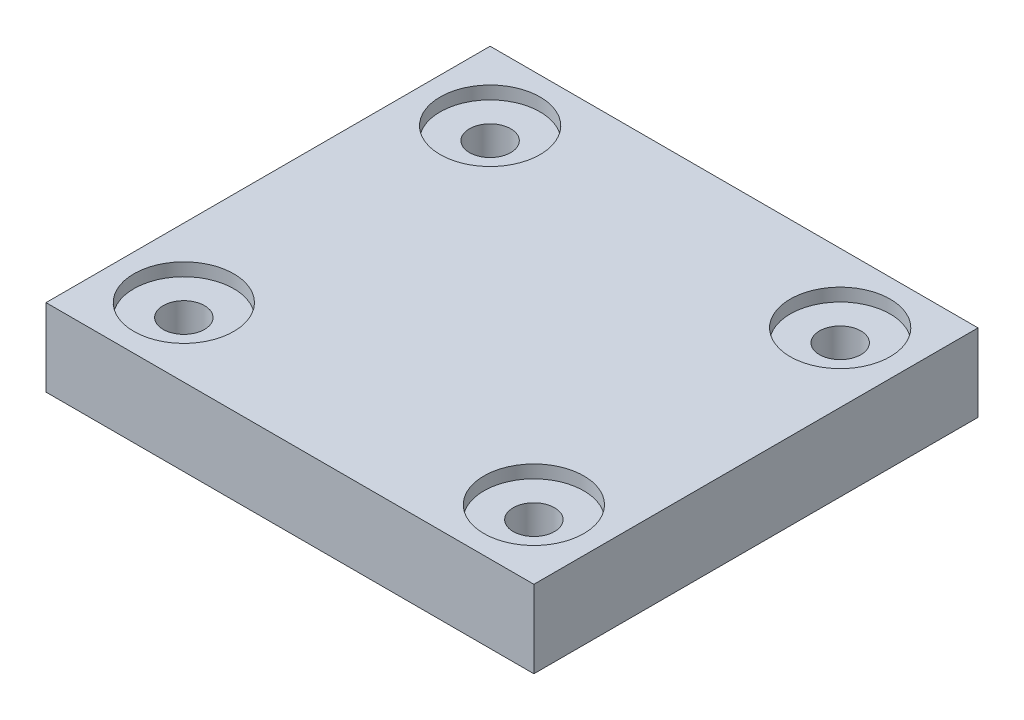
ISO-10303-21;
HEADER;
FILE_DESCRIPTION(('STEP AP214'),'2;1');
FILE_NAME('part.step','',(''),(''),'','','');
FILE_SCHEMA(('AUTOMOTIVE_DESIGN { 1 0 10303 214 1 1 1 1 }'));
ENDSEC;
DATA;
#1=APPLICATION_CONTEXT('core data for automotive mechanical design processes');
#2=APPLICATION_PROTOCOL_DEFINITION('international standard','automotive_design',2000,#1);
#3=PRODUCT_CONTEXT('',#1,'mechanical');
#4=PRODUCT('Part','Part','',(#3));
#5=PRODUCT_RELATED_PRODUCT_CATEGORY('part','',(#4));
#6=PRODUCT_DEFINITION_FORMATION('','',#4);
#7=PRODUCT_DEFINITION_CONTEXT('part definition',#1,'design');
#8=PRODUCT_DEFINITION('design','',#6,#7);
#9=PRODUCT_DEFINITION_SHAPE('','',#8);
#10=(LENGTH_UNIT() NAMED_UNIT(*) SI_UNIT(.MILLI.,.METRE.));
#11=(NAMED_UNIT(*) PLANE_ANGLE_UNIT() SI_UNIT($,.RADIAN.));
#12=(NAMED_UNIT(*) SI_UNIT($,.STERADIAN.) SOLID_ANGLE_UNIT());
#13=UNCERTAINTY_MEASURE_WITH_UNIT(LENGTH_MEASURE(1.E-05),#10,'distance_accuracy_value','');
#14=(GEOMETRIC_REPRESENTATION_CONTEXT(3) GLOBAL_UNCERTAINTY_ASSIGNED_CONTEXT((#13)) GLOBAL_UNIT_ASSIGNED_CONTEXT((#10,
#11,#12)) REPRESENTATION_CONTEXT('',''));
#15=CARTESIAN_POINT('',(0.,0.,0.));
#16=DIRECTION('',(0.,0.,1.));
#17=DIRECTION('',(1.,0.,0.));
#18=AXIS2_PLACEMENT_3D('',#15,#16,#17);
#19=CARTESIAN_POINT('',(-10.16,5.,-8.89));
#20=DIRECTION('',(0.,-1.,0.));
#21=DIRECTION('',(0.,0.,-1.));
#22=AXIS2_PLACEMENT_3D('',#19,#20,#21);
#23=CYLINDRICAL_SURFACE('',#22,1.2);
#24=CARTESIAN_POINT('',(-10.16,0.500000000000003,-8.89));
#25=DIRECTION('',(0.,1.,0.));
#26=DIRECTION('',(0.,0.,1.));
#27=AXIS2_PLACEMENT_3D('',#24,#25,#26);
#28=CIRCLE('',#27,1.2);
#29=CARTESIAN_POINT('',(-10.16,0.500000000000003,-7.69));
#30=VERTEX_POINT('',#29);
#31=EDGE_CURVE('E192',#30,#30,#28,.F.);
#32=ORIENTED_EDGE('',*,*,#31,.T.);
#33=EDGE_LOOP('',(#32));
#34=FACE_BOUND('',#33,.T.);
#35=CARTESIAN_POINT('',(-10.16,4.25,-8.89));
#36=DIRECTION('',(0.,1.,0.));
#37=DIRECTION('',(0.,0.,1.));
#38=AXIS2_PLACEMENT_3D('',#35,#36,#37);
#39=CIRCLE('',#38,1.2);
#40=CARTESIAN_POINT('',(-10.16,4.25,-7.69));
#41=VERTEX_POINT('',#40);
#42=EDGE_CURVE('E124',#41,#41,#39,.T.);
#43=ORIENTED_EDGE('',*,*,#42,.T.);
#44=EDGE_LOOP('',(#43));
#45=FACE_BOUND('',#44,.T.);
#46=ADVANCED_FACE('F46',(#34,#45),#23,.F.);
#47=CARTESIAN_POINT('',(10.16,5.,-8.89));
#48=DIRECTION('',(0.,-1.,0.));
#49=DIRECTION('',(0.,0.,-1.));
#50=AXIS2_PLACEMENT_3D('',#47,#48,#49);
#51=CYLINDRICAL_SURFACE('',#50,1.2);
#52=CARTESIAN_POINT('',(10.16,0.500000000000003,-8.89));
#53=DIRECTION('',(0.,1.,0.));
#54=DIRECTION('',(0.,0.,1.));
#55=AXIS2_PLACEMENT_3D('',#52,#53,#54);
#56=CIRCLE('',#55,1.2);
#57=CARTESIAN_POINT('',(10.16,0.500000000000003,-7.69));
#58=VERTEX_POINT('',#57);
#59=EDGE_CURVE('E188',#58,#58,#56,.F.);
#60=ORIENTED_EDGE('',*,*,#59,.T.);
#61=EDGE_LOOP('',(#60));
#62=FACE_BOUND('',#61,.T.);
#63=CARTESIAN_POINT('',(10.16,4.25,-8.89));
#64=DIRECTION('',(0.,1.,0.));
#65=DIRECTION('',(0.,0.,1.));
#66=AXIS2_PLACEMENT_3D('',#63,#64,#65);
#67=CIRCLE('',#66,1.2);
#68=CARTESIAN_POINT('',(10.16,4.25,-7.69));
#69=VERTEX_POINT('',#68);
#70=EDGE_CURVE('E148',#69,#69,#67,.T.);
#71=ORIENTED_EDGE('',*,*,#70,.T.);
#72=EDGE_LOOP('',(#71));
#73=FACE_BOUND('',#72,.T.);
#74=ADVANCED_FACE('F267',(#62,#73),#51,.F.);
#75=CARTESIAN_POINT('',(10.16,5.,8.89));
#76=DIRECTION('',(0.,-1.,0.));
#77=DIRECTION('',(0.,0.,-1.));
#78=AXIS2_PLACEMENT_3D('',#75,#76,#77);
#79=CYLINDRICAL_SURFACE('',#78,1.2);
#80=CARTESIAN_POINT('',(10.16,0.499999999999993,8.89));
#81=DIRECTION('',(0.,1.,0.));
#82=DIRECTION('',(0.,0.,1.));
#83=AXIS2_PLACEMENT_3D('',#80,#81,#82);
#84=CIRCLE('',#83,1.2);
#85=CARTESIAN_POINT('',(10.16,0.499999999999993,10.09));
#86=VERTEX_POINT('',#85);
#87=EDGE_CURVE('E184',#86,#86,#84,.F.);
#88=ORIENTED_EDGE('',*,*,#87,.T.);
#89=EDGE_LOOP('',(#88));
#90=FACE_BOUND('',#89,.T.);
#91=CARTESIAN_POINT('',(10.16,4.25,8.89));
#92=DIRECTION('',(0.,1.,0.));
#93=DIRECTION('',(0.,0.,1.));
#94=AXIS2_PLACEMENT_3D('',#91,#92,#93);
#95=CIRCLE('',#94,1.2);
#96=CARTESIAN_POINT('',(10.16,4.25,10.09));
#97=VERTEX_POINT('',#96);
#98=EDGE_CURVE('E143',#97,#97,#95,.T.);
#99=ORIENTED_EDGE('',*,*,#98,.T.);
#100=EDGE_LOOP('',(#99));
#101=FACE_BOUND('',#100,.T.);
#102=ADVANCED_FACE('F274',(#90,#101),#79,.F.);
#103=CARTESIAN_POINT('',(-10.16,5.,8.89));
#104=DIRECTION('',(0.,-1.,0.));
#105=DIRECTION('',(0.,0.,-1.));
#106=AXIS2_PLACEMENT_3D('',#103,#104,#105);
#107=CYLINDRICAL_SURFACE('',#106,1.2);
#108=CARTESIAN_POINT('',(-10.16,0.499999999999993,8.89));
#109=DIRECTION('',(0.,1.,0.));
#110=DIRECTION('',(0.,0.,1.));
#111=AXIS2_PLACEMENT_3D('',#108,#109,#110);
#112=CIRCLE('',#111,1.2);
#113=CARTESIAN_POINT('',(-10.16,0.499999999999993,10.09));
#114=VERTEX_POINT('',#113);
#115=EDGE_CURVE('E180',#114,#114,#112,.F.);
#116=ORIENTED_EDGE('',*,*,#115,.T.);
#117=EDGE_LOOP('',(#116));
#118=FACE_BOUND('',#117,.T.);
#119=CARTESIAN_POINT('',(-10.16,4.25,8.89));
#120=DIRECTION('',(0.,1.,0.));
#121=DIRECTION('',(0.,0.,1.));
#122=AXIS2_PLACEMENT_3D('',#119,#120,#121);
#123=CIRCLE('',#122,1.2);
#124=CARTESIAN_POINT('',(-10.16,4.25,10.09));
#125=VERTEX_POINT('',#124);
#126=EDGE_CURVE('E139',#125,#125,#123,.T.);
#127=ORIENTED_EDGE('',*,*,#126,.T.);
#128=EDGE_LOOP('',(#127));
#129=FACE_BOUND('',#128,.T.);
#130=ADVANCED_FACE('F283',(#118,#129),#107,.F.);
#131=CARTESIAN_POINT('',(0.,5.,0.));
#132=DIRECTION('',(0.,1.,0.));
#133=DIRECTION('',(0.,0.,1.));
#134=AXIS2_PLACEMENT_3D('',#131,#132,#133);
#135=PLANE('',#134);
#136=CARTESIAN_POINT('',(-10.16,5.,8.89));
#137=DIRECTION('',(0.,1.,0.));
#138=DIRECTION('',(0.,0.,1.));
#139=AXIS2_PLACEMENT_3D('',#136,#137,#138);
#140=CIRCLE('',#139,2.9);
#141=CARTESIAN_POINT('',(-10.16,5.,11.79));
#142=VERTEX_POINT('',#141);
#143=EDGE_CURVE('E222',#142,#142,#140,.T.);
#144=ORIENTED_EDGE('',*,*,#143,.F.);
#145=EDGE_LOOP('',(#144));
#146=FACE_BOUND('',#145,.T.);
#147=CARTESIAN_POINT('',(10.16,5.,8.89));
#148=DIRECTION('',(0.,1.,0.));
#149=DIRECTION('',(0.,0.,1.));
#150=AXIS2_PLACEMENT_3D('',#147,#148,#149);
#151=CIRCLE('',#150,2.9);
#152=CARTESIAN_POINT('',(10.16,5.,11.79));
#153=VERTEX_POINT('',#152);
#154=EDGE_CURVE('E386',#153,#153,#151,.T.);
#155=ORIENTED_EDGE('',*,*,#154,.F.);
#156=EDGE_LOOP('',(#155));
#157=FACE_BOUND('',#156,.T.);
#158=CARTESIAN_POINT('',(10.16,5.,-8.89));
#159=DIRECTION('',(0.,1.,0.));
#160=DIRECTION('',(0.,0.,1.));
#161=AXIS2_PLACEMENT_3D('',#158,#159,#160);
#162=CIRCLE('',#161,2.9);
#163=CARTESIAN_POINT('',(10.16,5.,-5.99));
#164=VERTEX_POINT('',#163);
#165=EDGE_CURVE('E238',#164,#164,#162,.T.);
#166=ORIENTED_EDGE('',*,*,#165,.F.);
#167=EDGE_LOOP('',(#166));
#168=FACE_BOUND('',#167,.T.);
#169=CARTESIAN_POINT('',(-10.16,5.,-8.89));
#170=DIRECTION('',(0.,1.,0.));
#171=DIRECTION('',(0.,0.,1.));
#172=AXIS2_PLACEMENT_3D('',#169,#170,#171);
#173=CIRCLE('',#172,2.9);
#174=CARTESIAN_POINT('',(-10.16,5.,-5.99));
#175=VERTEX_POINT('',#174);
#176=EDGE_CURVE('E235',#175,#175,#173,.T.);
#177=ORIENTED_EDGE('',*,*,#176,.F.);
#178=EDGE_LOOP('',(#177));
#179=FACE_BOUND('',#178,.T.);
#180=DIRECTION('',(1.,0.,0.));
#181=VECTOR('',#180,1.);
#182=CARTESIAN_POINT('',(-14.16,5.,12.89));
#183=LINE('',#182,#181);
#184=CARTESIAN_POINT('',(-14.16,5.,12.89));
#185=VERTEX_POINT('',#184);
#186=CARTESIAN_POINT('',(14.16,5.,12.89));
#187=VERTEX_POINT('',#186);
#188=EDGE_CURVE('E116',#185,#187,#183,.T.);
#189=ORIENTED_EDGE('',*,*,#188,.T.);
#190=DIRECTION('',(0.,0.,-1.));
#191=VECTOR('',#190,1.);
#192=CARTESIAN_POINT('',(14.16,5.,12.89));
#193=LINE('',#192,#191);
#194=CARTESIAN_POINT('',(14.16,5.,-12.89));
#195=VERTEX_POINT('',#194);
#196=EDGE_CURVE('E104',#187,#195,#193,.T.);
#197=ORIENTED_EDGE('',*,*,#196,.T.);
#198=DIRECTION('',(-1.,0.,0.));
#199=VECTOR('',#198,1.);
#200=CARTESIAN_POINT('',(-14.16,5.,-12.89));
#201=LINE('',#200,#199);
#202=CARTESIAN_POINT('',(-14.16,5.,-12.89));
#203=VERTEX_POINT('',#202);
#204=EDGE_CURVE('E115',#195,#203,#201,.T.);
#205=ORIENTED_EDGE('',*,*,#204,.T.);
#206=DIRECTION('',(0.,0.,1.));
#207=VECTOR('',#206,1.);
#208=CARTESIAN_POINT('',(-14.16,5.,12.89));
#209=LINE('',#208,#207);
#210=EDGE_CURVE('E121',#203,#185,#209,.T.);
#211=ORIENTED_EDGE('',*,*,#210,.T.);
#212=EDGE_LOOP('',(#189,#197,#205,#211));
#213=FACE_BOUND('',#212,.T.);
#214=ADVANCED_FACE('F119',(#146,#157,#168,#179,#213),#135,.T.);
#215=CARTESIAN_POINT('',(0.,0.,0.));
#216=DIRECTION('',(0.,1.,0.));
#217=DIRECTION('',(0.,0.,1.));
#218=AXIS2_PLACEMENT_3D('',#215,#216,#217);
#219=PLANE('',#218);
#220=CARTESIAN_POINT('',(-10.16,0.,8.89));
#221=DIRECTION('',(0.,1.,0.));
#222=DIRECTION('',(0.,0.,1.));
#223=AXIS2_PLACEMENT_3D('',#220,#221,#222);
#224=CIRCLE('',#223,1.69999999999999);
#225=CARTESIAN_POINT('',(-10.16,0.,10.59));
#226=VERTEX_POINT('',#225);
#227=EDGE_CURVE('E176',#226,#226,#224,.T.);
#228=ORIENTED_EDGE('',*,*,#227,.T.);
#229=EDGE_LOOP('',(#228));
#230=FACE_BOUND('',#229,.T.);
#231=CARTESIAN_POINT('',(10.16,0.,8.89));
#232=DIRECTION('',(0.,1.,0.));
#233=DIRECTION('',(0.,0.,1.));
#234=AXIS2_PLACEMENT_3D('',#231,#232,#233);
#235=CIRCLE('',#234,1.69999999999999);
#236=CARTESIAN_POINT('',(10.16,0.,10.59));
#237=VERTEX_POINT('',#236);
#238=EDGE_CURVE('E172',#237,#237,#235,.T.);
#239=ORIENTED_EDGE('',*,*,#238,.T.);
#240=EDGE_LOOP('',(#239));
#241=FACE_BOUND('',#240,.T.);
#242=CARTESIAN_POINT('',(10.16,0.,-8.89));
#243=DIRECTION('',(0.,1.,0.));
#244=DIRECTION('',(0.,0.,1.));
#245=AXIS2_PLACEMENT_3D('',#242,#243,#244);
#246=CIRCLE('',#245,1.7);
#247=CARTESIAN_POINT('',(10.16,0.,-7.19));
#248=VERTEX_POINT('',#247);
#249=EDGE_CURVE('E168',#248,#248,#246,.T.);
#250=ORIENTED_EDGE('',*,*,#249,.T.);
#251=EDGE_LOOP('',(#250));
#252=FACE_BOUND('',#251,.T.);
#253=CARTESIAN_POINT('',(-10.16,0.,-8.89));
#254=DIRECTION('',(0.,1.,0.));
#255=DIRECTION('',(0.,0.,1.));
#256=AXIS2_PLACEMENT_3D('',#253,#254,#255);
#257=CIRCLE('',#256,1.7);
#258=CARTESIAN_POINT('',(-10.16,0.,-7.19));
#259=VERTEX_POINT('',#258);
#260=EDGE_CURVE('E164',#259,#259,#257,.T.);
#261=ORIENTED_EDGE('',*,*,#260,.T.);
#262=EDGE_LOOP('',(#261));
#263=FACE_BOUND('',#262,.T.);
#264=DIRECTION('',(1.,0.,0.));
#265=VECTOR('',#264,1.);
#266=CARTESIAN_POINT('',(0.,0.,-12.39));
#267=LINE('',#266,#265);
#268=CARTESIAN_POINT('',(-13.66,0.,-12.39));
#269=VERTEX_POINT('',#268);
#270=CARTESIAN_POINT('',(13.66,0.,-12.39));
#271=VERTEX_POINT('',#270);
#272=EDGE_CURVE('E157',#269,#271,#267,.T.);
#273=ORIENTED_EDGE('',*,*,#272,.T.);
#274=DIRECTION('',(0.,0.,1.));
#275=VECTOR('',#274,1.);
#276=CARTESIAN_POINT('',(13.66,0.,0.));
#277=LINE('',#276,#275);
#278=CARTESIAN_POINT('',(13.66,0.,12.39));
#279=VERTEX_POINT('',#278);
#280=EDGE_CURVE('E160',#271,#279,#277,.T.);
#281=ORIENTED_EDGE('',*,*,#280,.T.);
#282=DIRECTION('',(-1.,0.,0.));
#283=VECTOR('',#282,1.);
#284=CARTESIAN_POINT('',(0.,0.,12.39));
#285=LINE('',#284,#283);
#286=CARTESIAN_POINT('',(-13.66,0.,12.39));
#287=VERTEX_POINT('',#286);
#288=EDGE_CURVE('E129',#279,#287,#285,.T.);
#289=ORIENTED_EDGE('',*,*,#288,.T.);
#290=DIRECTION('',(0.,0.,-1.));
#291=VECTOR('',#290,1.);
#292=CARTESIAN_POINT('',(-13.66,0.,0.));
#293=LINE('',#292,#291);
#294=EDGE_CURVE('E133',#287,#269,#293,.T.);
#295=ORIENTED_EDGE('',*,*,#294,.T.);
#296=EDGE_LOOP('',(#273,#281,#289,#295));
#297=FACE_BOUND('',#296,.T.);
#298=ADVANCED_FACE('F282',(#230,#241,#252,#263,#297),#219,.F.);
#299=CARTESIAN_POINT('',(-14.16,5.,12.89));
#300=DIRECTION('',(0.,0.,-1.));
#301=DIRECTION('',(-1.,0.,0.));
#302=AXIS2_PLACEMENT_3D('',#299,#300,#301);
#303=PLANE('',#302);
#304=DIRECTION('',(0.,-1.,0.));
#305=VECTOR('',#304,1.);
#306=CARTESIAN_POINT('',(-14.16,5.,12.89));
#307=LINE('',#306,#305);
#308=CARTESIAN_POINT('',(-14.16,0.499999999999997,12.89));
#309=VERTEX_POINT('',#308);
#310=EDGE_CURVE('E244',#185,#309,#307,.T.);
#311=ORIENTED_EDGE('',*,*,#310,.T.);
#312=DIRECTION('',(1.,0.,0.));
#313=VECTOR('',#312,1.);
#314=CARTESIAN_POINT('',(-14.16,0.499999999999997,12.89));
#315=LINE('',#314,#313);
#316=CARTESIAN_POINT('',(14.16,0.499999999999997,12.89));
#317=VERTEX_POINT('',#316);
#318=EDGE_CURVE('E11',#309,#317,#315,.T.);
#319=ORIENTED_EDGE('',*,*,#318,.T.);
#320=DIRECTION('',(0.,-1.,0.));
#321=VECTOR('',#320,1.);
#322=CARTESIAN_POINT('',(14.16,5.,12.89));
#323=LINE('',#322,#321);
#324=EDGE_CURVE('E109',#187,#317,#323,.T.);
#325=ORIENTED_EDGE('',*,*,#324,.F.);
#326=ORIENTED_EDGE('',*,*,#188,.F.);
#327=EDGE_LOOP('',(#311,#319,#325,#326));
#328=FACE_BOUND('',#327,.T.);
#329=ADVANCED_FACE('F126',(#328),#303,.F.);
#330=CARTESIAN_POINT('',(14.16,5.,12.89));
#331=DIRECTION('',(-1.,0.,0.));
#332=DIRECTION('',(0.,0.,1.));
#333=AXIS2_PLACEMENT_3D('',#330,#331,#332);
#334=PLANE('',#333);
#335=ORIENTED_EDGE('',*,*,#324,.T.);
#336=DIRECTION('',(0.,0.,-1.));
#337=VECTOR('',#336,1.);
#338=CARTESIAN_POINT('',(14.16,0.499999999999997,12.89));
#339=LINE('',#338,#337);
#340=CARTESIAN_POINT('',(14.16,0.499999999999997,-12.89));
#341=VERTEX_POINT('',#340);
#342=EDGE_CURVE('E196',#317,#341,#339,.T.);
#343=ORIENTED_EDGE('',*,*,#342,.T.);
#344=DIRECTION('',(0.,-1.,0.));
#345=VECTOR('',#344,1.);
#346=CARTESIAN_POINT('',(14.16,5.,-12.89));
#347=LINE('',#346,#345);
#348=EDGE_CURVE('E111',#195,#341,#347,.T.);
#349=ORIENTED_EDGE('',*,*,#348,.F.);
#350=ORIENTED_EDGE('',*,*,#196,.F.);
#351=EDGE_LOOP('',(#335,#343,#349,#350));
#352=FACE_BOUND('',#351,.T.);
#353=ADVANCED_FACE('F106',(#352),#334,.F.);
#354=CARTESIAN_POINT('',(-14.16,5.,-12.89));
#355=DIRECTION('',(0.,0.,1.));
#356=DIRECTION('',(1.,0.,0.));
#357=AXIS2_PLACEMENT_3D('',#354,#355,#356);
#358=PLANE('',#357);
#359=ORIENTED_EDGE('',*,*,#348,.T.);
#360=DIRECTION('',(-1.,0.,0.));
#361=VECTOR('',#360,1.);
#362=CARTESIAN_POINT('',(-14.16,0.499999999999997,-12.89));
#363=LINE('',#362,#361);
#364=CARTESIAN_POINT('',(-14.16,0.499999999999997,-12.89));
#365=VERTEX_POINT('',#364);
#366=EDGE_CURVE('E72',#341,#365,#363,.T.);
#367=ORIENTED_EDGE('',*,*,#366,.T.);
#368=DIRECTION('',(0.,-1.,0.));
#369=VECTOR('',#368,1.);
#370=CARTESIAN_POINT('',(-14.16,5.,-12.89));
#371=LINE('',#370,#369);
#372=EDGE_CURVE('E135',#203,#365,#371,.T.);
#373=ORIENTED_EDGE('',*,*,#372,.F.);
#374=ORIENTED_EDGE('',*,*,#204,.F.);
#375=EDGE_LOOP('',(#359,#367,#373,#374));
#376=FACE_BOUND('',#375,.T.);
#377=ADVANCED_FACE('F256',(#376),#358,.F.);
#378=CARTESIAN_POINT('',(-14.16,5.,12.89));
#379=DIRECTION('',(1.,0.,0.));
#380=DIRECTION('',(0.,0.,-1.));
#381=AXIS2_PLACEMENT_3D('',#378,#379,#380);
#382=PLANE('',#381);
#383=ORIENTED_EDGE('',*,*,#372,.T.);
#384=DIRECTION('',(0.,0.,1.));
#385=VECTOR('',#384,1.);
#386=CARTESIAN_POINT('',(-14.16,0.499999999999997,12.89));
#387=LINE('',#386,#385);
#388=EDGE_CURVE('E57',#365,#309,#387,.T.);
#389=ORIENTED_EDGE('',*,*,#388,.T.);
#390=ORIENTED_EDGE('',*,*,#310,.F.);
#391=ORIENTED_EDGE('',*,*,#210,.F.);
#392=EDGE_LOOP('',(#383,#389,#390,#391));
#393=FACE_BOUND('',#392,.T.);
#394=ADVANCED_FACE('F247',(#393),#382,.F.);
#395=CARTESIAN_POINT('',(-10.16,4.25,8.89));
#396=DIRECTION('',(0.,1.,0.));
#397=DIRECTION('',(0.,0.,1.));
#398=AXIS2_PLACEMENT_3D('',#395,#396,#397);
#399=CYLINDRICAL_SURFACE('',#398,2.9);
#400=CARTESIAN_POINT('',(-10.16,4.25,8.89));
#401=DIRECTION('',(0.,1.,0.));
#402=DIRECTION('',(0.,0.,1.));
#403=AXIS2_PLACEMENT_3D('',#400,#401,#402);
#404=CIRCLE('',#403,2.9);
#405=CARTESIAN_POINT('',(-10.16,4.25,11.79));
#406=VERTEX_POINT('',#405);
#407=EDGE_CURVE('E216',#406,#406,#404,.T.);
#408=ORIENTED_EDGE('',*,*,#407,.F.);
#409=EDGE_LOOP('',(#408));
#410=FACE_BOUND('',#409,.T.);
#411=ORIENTED_EDGE('',*,*,#143,.T.);
#412=EDGE_LOOP('',(#411));
#413=FACE_BOUND('',#412,.T.);
#414=ADVANCED_FACE('F263',(#410,#413),#399,.F.);
#415=CARTESIAN_POINT('',(-10.16,4.25,8.89));
#416=DIRECTION('',(0.,1.,0.));
#417=DIRECTION('',(0.,0.,1.));
#418=AXIS2_PLACEMENT_3D('',#415,#416,#417);
#419=PLANE('',#418);
#420=ORIENTED_EDGE('',*,*,#126,.F.);
#421=EDGE_LOOP('',(#420));
#422=FACE_BOUND('',#421,.T.);
#423=ORIENTED_EDGE('',*,*,#407,.T.);
#424=EDGE_LOOP('',(#423));
#425=FACE_BOUND('',#424,.T.);
#426=ADVANCED_FACE('F354',(#422,#425),#419,.T.);
#427=CARTESIAN_POINT('',(10.16,4.25,8.89));
#428=DIRECTION('',(0.,1.,0.));
#429=DIRECTION('',(0.,0.,1.));
#430=AXIS2_PLACEMENT_3D('',#427,#428,#429);
#431=CYLINDRICAL_SURFACE('',#430,2.9);
#432=CARTESIAN_POINT('',(10.16,4.25,8.89));
#433=DIRECTION('',(0.,1.,0.));
#434=DIRECTION('',(0.,0.,1.));
#435=AXIS2_PLACEMENT_3D('',#432,#433,#434);
#436=CIRCLE('',#435,2.9);
#437=CARTESIAN_POINT('',(10.16,4.25,11.79));
#438=VERTEX_POINT('',#437);
#439=EDGE_CURVE('E228',#438,#438,#436,.T.);
#440=ORIENTED_EDGE('',*,*,#439,.F.);
#441=EDGE_LOOP('',(#440));
#442=FACE_BOUND('',#441,.T.);
#443=ORIENTED_EDGE('',*,*,#154,.T.);
#444=EDGE_LOOP('',(#443));
#445=FACE_BOUND('',#444,.T.);
#446=ADVANCED_FACE('F356',(#442,#445),#431,.F.);
#447=CARTESIAN_POINT('',(10.16,4.25,8.89));
#448=DIRECTION('',(0.,1.,0.));
#449=DIRECTION('',(0.,0.,1.));
#450=AXIS2_PLACEMENT_3D('',#447,#448,#449);
#451=PLANE('',#450);
#452=ORIENTED_EDGE('',*,*,#98,.F.);
#453=EDGE_LOOP('',(#452));
#454=FACE_BOUND('',#453,.T.);
#455=ORIENTED_EDGE('',*,*,#439,.T.);
#456=EDGE_LOOP('',(#455));
#457=FACE_BOUND('',#456,.T.);
#458=ADVANCED_FACE('F362',(#454,#457),#451,.T.);
#459=CARTESIAN_POINT('',(10.16,4.25,-8.89));
#460=DIRECTION('',(0.,1.,0.));
#461=DIRECTION('',(0.,0.,1.));
#462=AXIS2_PLACEMENT_3D('',#459,#460,#461);
#463=CYLINDRICAL_SURFACE('',#462,2.9);
#464=CARTESIAN_POINT('',(10.16,4.25,-8.89));
#465=DIRECTION('',(0.,1.,0.));
#466=DIRECTION('',(0.,0.,1.));
#467=AXIS2_PLACEMENT_3D('',#464,#465,#466);
#468=CIRCLE('',#467,2.9);
#469=CARTESIAN_POINT('',(10.16,4.25,-5.99));
#470=VERTEX_POINT('',#469);
#471=EDGE_CURVE('E389',#470,#470,#468,.T.);
#472=ORIENTED_EDGE('',*,*,#471,.F.);
#473=EDGE_LOOP('',(#472));
#474=FACE_BOUND('',#473,.T.);
#475=ORIENTED_EDGE('',*,*,#165,.T.);
#476=EDGE_LOOP('',(#475));
#477=FACE_BOUND('',#476,.T.);
#478=ADVANCED_FACE('F382',(#474,#477),#463,.F.);
#479=CARTESIAN_POINT('',(10.16,4.25,-8.89));
#480=DIRECTION('',(0.,1.,0.));
#481=DIRECTION('',(0.,0.,1.));
#482=AXIS2_PLACEMENT_3D('',#479,#480,#481);
#483=PLANE('',#482);
#484=ORIENTED_EDGE('',*,*,#70,.F.);
#485=EDGE_LOOP('',(#484));
#486=FACE_BOUND('',#485,.T.);
#487=ORIENTED_EDGE('',*,*,#471,.T.);
#488=EDGE_LOOP('',(#487));
#489=FACE_BOUND('',#488,.T.);
#490=ADVANCED_FACE('F370',(#486,#489),#483,.T.);
#491=CARTESIAN_POINT('',(-10.16,4.25,-8.89));
#492=DIRECTION('',(0.,1.,0.));
#493=DIRECTION('',(0.,0.,1.));
#494=AXIS2_PLACEMENT_3D('',#491,#492,#493);
#495=CYLINDRICAL_SURFACE('',#494,2.9);
#496=CARTESIAN_POINT('',(-10.16,4.25,-8.89));
#497=DIRECTION('',(0.,1.,0.));
#498=DIRECTION('',(0.,0.,1.));
#499=AXIS2_PLACEMENT_3D('',#496,#497,#498);
#500=CIRCLE('',#499,2.9);
#501=CARTESIAN_POINT('',(-10.16,4.25,-5.99));
#502=VERTEX_POINT('',#501);
#503=EDGE_CURVE('E144',#502,#502,#500,.T.);
#504=ORIENTED_EDGE('',*,*,#503,.F.);
#505=EDGE_LOOP('',(#504));
#506=FACE_BOUND('',#505,.T.);
#507=ORIENTED_EDGE('',*,*,#176,.T.);
#508=EDGE_LOOP('',(#507));
#509=FACE_BOUND('',#508,.T.);
#510=ADVANCED_FACE('F344',(#506,#509),#495,.F.);
#511=CARTESIAN_POINT('',(-10.16,4.25,-8.89));
#512=DIRECTION('',(0.,1.,0.));
#513=DIRECTION('',(0.,0.,1.));
#514=AXIS2_PLACEMENT_3D('',#511,#512,#513);
#515=PLANE('',#514);
#516=ORIENTED_EDGE('',*,*,#42,.F.);
#517=EDGE_LOOP('',(#516));
#518=FACE_BOUND('',#517,.T.);
#519=ORIENTED_EDGE('',*,*,#503,.T.);
#520=EDGE_LOOP('',(#519));
#521=FACE_BOUND('',#520,.T.);
#522=ADVANCED_FACE('F338',(#518,#521),#515,.T.);
#523=CARTESIAN_POINT('',(-10.16,0.,8.89));
#524=DIRECTION('',(0.,-1.,0.));
#525=DIRECTION('',(0.,0.,-1.));
#526=AXIS2_PLACEMENT_3D('',#523,#524,#525);
#527=CONICAL_SURFACE('',#526,1.69999999999999,0.785398163397449);
#528=ORIENTED_EDGE('',*,*,#115,.F.);
#529=EDGE_LOOP('',(#528));
#530=FACE_BOUND('',#529,.T.);
#531=ORIENTED_EDGE('',*,*,#227,.F.);
#532=EDGE_LOOP('',(#531));
#533=FACE_BOUND('',#532,.T.);
#534=ADVANCED_FACE('F336',(#530,#533),#527,.F.);
#535=CARTESIAN_POINT('',(10.16,0.,8.89));
#536=DIRECTION('',(0.,-1.,0.));
#537=DIRECTION('',(0.,0.,-1.));
#538=AXIS2_PLACEMENT_3D('',#535,#536,#537);
#539=CONICAL_SURFACE('',#538,1.69999999999999,0.785398163397449);
#540=ORIENTED_EDGE('',*,*,#87,.F.);
#541=EDGE_LOOP('',(#540));
#542=FACE_BOUND('',#541,.T.);
#543=ORIENTED_EDGE('',*,*,#238,.F.);
#544=EDGE_LOOP('',(#543));
#545=FACE_BOUND('',#544,.T.);
#546=ADVANCED_FACE('F332',(#542,#545),#539,.F.);
#547=CARTESIAN_POINT('',(10.16,0.,-8.89));
#548=DIRECTION('',(0.,-1.,0.));
#549=DIRECTION('',(0.,0.,-1.));
#550=AXIS2_PLACEMENT_3D('',#547,#548,#549);
#551=CONICAL_SURFACE('',#550,1.7,0.785398163397449);
#552=ORIENTED_EDGE('',*,*,#59,.F.);
#553=EDGE_LOOP('',(#552));
#554=FACE_BOUND('',#553,.T.);
#555=ORIENTED_EDGE('',*,*,#249,.F.);
#556=EDGE_LOOP('',(#555));
#557=FACE_BOUND('',#556,.T.);
#558=ADVANCED_FACE('F327',(#554,#557),#551,.F.);
#559=CARTESIAN_POINT('',(-10.16,0.,-8.89));
#560=DIRECTION('',(0.,-1.,0.));
#561=DIRECTION('',(0.,0.,-1.));
#562=AXIS2_PLACEMENT_3D('',#559,#560,#561);
#563=CONICAL_SURFACE('',#562,1.7,0.785398163397449);
#564=ORIENTED_EDGE('',*,*,#31,.F.);
#565=EDGE_LOOP('',(#564));
#566=FACE_BOUND('',#565,.T.);
#567=ORIENTED_EDGE('',*,*,#260,.F.);
#568=EDGE_LOOP('',(#567));
#569=FACE_BOUND('',#568,.T.);
#570=ADVANCED_FACE('F322',(#566,#569),#563,.F.);
#571=CARTESIAN_POINT('',(-14.16,0.499999999999997,12.89));
#572=DIRECTION('',(0.707106781186547,0.707106781186547,0.));
#573=DIRECTION('',(0.,0.,1.));
#574=AXIS2_PLACEMENT_3D('',#571,#572,#573);
#575=PLANE('',#574);
#576=DIRECTION('',(0.577350269189626,-0.577350269189625,0.577350269189626));
#577=VECTOR('',#576,1.);
#578=CARTESIAN_POINT('',(-5.56666666666666,-8.09333333333334,-4.29666666666665));
#579=LINE('',#578,#577);
#580=EDGE_CURVE('E208',#269,#365,#579,.F.);
#581=ORIENTED_EDGE('',*,*,#580,.F.);
#582=ORIENTED_EDGE('',*,*,#294,.F.);
#583=DIRECTION('',(0.577350269189626,-0.577350269189626,-0.577350269189626));
#584=VECTOR('',#583,1.);
#585=CARTESIAN_POINT('',(-14.16,0.499999999999997,12.89));
#586=LINE('',#585,#584);
#587=EDGE_CURVE('E51',#309,#287,#586,.T.);
#588=ORIENTED_EDGE('',*,*,#587,.F.);
#589=ORIENTED_EDGE('',*,*,#388,.F.);
#590=EDGE_LOOP('',(#581,#582,#588,#589));
#591=FACE_BOUND('',#590,.T.);
#592=ADVANCED_FACE('F49',(#591),#575,.F.);
#593=CARTESIAN_POINT('',(-14.16,0.499999999999997,12.89));
#594=DIRECTION('',(0.,0.707106781186547,-0.707106781186547));
#595=DIRECTION('',(1.,0.,0.));
#596=AXIS2_PLACEMENT_3D('',#593,#594,#595);
#597=PLANE('',#596);
#598=ORIENTED_EDGE('',*,*,#587,.T.);
#599=ORIENTED_EDGE('',*,*,#288,.F.);
#600=DIRECTION('',(0.577350269189625,0.577350269189626,0.577350269189626));
#601=VECTOR('',#600,1.);
#602=CARTESIAN_POINT('',(4.72000000000002,-8.94,3.45000000000001));
#603=LINE('',#602,#601);
#604=EDGE_CURVE('E206',#317,#279,#603,.F.);
#605=ORIENTED_EDGE('',*,*,#604,.F.);
#606=ORIENTED_EDGE('',*,*,#318,.F.);
#607=EDGE_LOOP('',(#598,#599,#605,#606));
#608=FACE_BOUND('',#607,.T.);
#609=ADVANCED_FACE('F250',(#608),#597,.F.);
#610=CARTESIAN_POINT('',(-14.16,0.499999999999997,-12.89));
#611=DIRECTION('',(0.,0.707106781186548,0.707106781186547));
#612=DIRECTION('',(-1.,0.,0.));
#613=AXIS2_PLACEMENT_3D('',#610,#611,#612);
#614=PLANE('',#613);
#615=ORIENTED_EDGE('',*,*,#580,.T.);
#616=ORIENTED_EDGE('',*,*,#366,.F.);
#617=DIRECTION('',(-0.577350269189625,-0.577350269189626,0.577350269189627));
#618=VECTOR('',#617,1.);
#619=CARTESIAN_POINT('',(4.72000000000003,-8.93999999999999,-3.45));
#620=LINE('',#619,#618);
#621=EDGE_CURVE('E203',#271,#341,#620,.F.);
#622=ORIENTED_EDGE('',*,*,#621,.F.);
#623=ORIENTED_EDGE('',*,*,#272,.F.);
#624=EDGE_LOOP('',(#615,#616,#622,#623));
#625=FACE_BOUND('',#624,.T.);
#626=ADVANCED_FACE('F300',(#625),#614,.F.);
#627=CARTESIAN_POINT('',(14.16,0.499999999999997,12.89));
#628=DIRECTION('',(-0.707106781186548,0.707106781186547,0.));
#629=DIRECTION('',(0.,0.,-1.));
#630=AXIS2_PLACEMENT_3D('',#627,#628,#629);
#631=PLANE('',#630);
#632=ORIENTED_EDGE('',*,*,#604,.T.);
#633=ORIENTED_EDGE('',*,*,#280,.F.);
#634=ORIENTED_EDGE('',*,*,#621,.T.);
#635=ORIENTED_EDGE('',*,*,#342,.F.);
#636=EDGE_LOOP('',(#632,#633,#634,#635));
#637=FACE_BOUND('',#636,.T.);
#638=ADVANCED_FACE('F254',(#637),#631,.F.);
#639=CLOSED_SHELL('',(#46,#74,#102,#130,#214,#298,#329,#353,#377,#394,#414,#426,#446,#458,#478,
#490,#510,#522,#534,#546,#558,#570,#592,#609,#626,#638));
#640=MANIFOLD_SOLID_BREP('B2',#639);
#641=ADVANCED_BREP_SHAPE_REPRESENTATION('',(#18,#640),#14);
#642=SHAPE_DEFINITION_REPRESENTATION(#9,#641);
ENDSEC;
END-ISO-10303-21;
